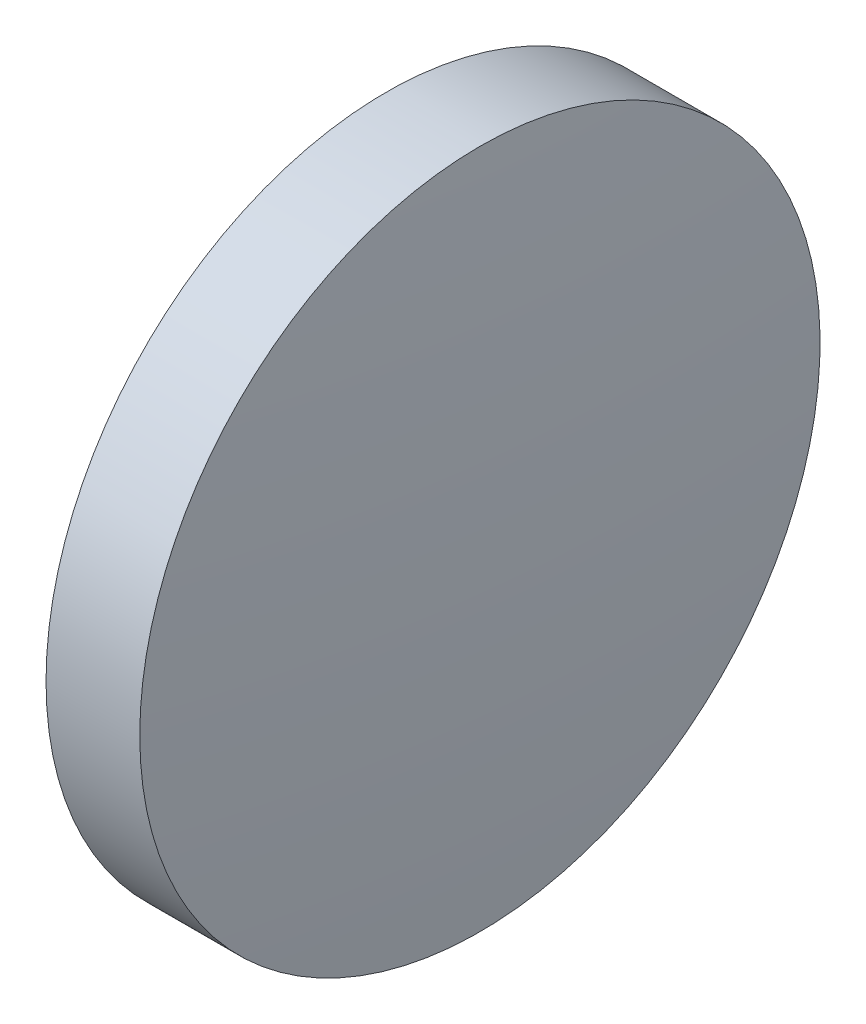
ISO-10303-21;
HEADER;
FILE_DESCRIPTION(('STEP AP214'),'2;1');
FILE_NAME('part.step','',(''),(''),'','','');
FILE_SCHEMA(('AUTOMOTIVE_DESIGN { 1 0 10303 214 1 1 1 1 }'));
ENDSEC;
DATA;
#1=APPLICATION_CONTEXT('core data for automotive mechanical design processes');
#2=APPLICATION_PROTOCOL_DEFINITION('international standard','automotive_design',2000,#1);
#3=PRODUCT_CONTEXT('',#1,'mechanical');
#4=PRODUCT('Part','Part','',(#3));
#5=PRODUCT_RELATED_PRODUCT_CATEGORY('part','',(#4));
#6=PRODUCT_DEFINITION_FORMATION('','',#4);
#7=PRODUCT_DEFINITION_CONTEXT('part definition',#1,'design');
#8=PRODUCT_DEFINITION('design','',#6,#7);
#9=PRODUCT_DEFINITION_SHAPE('','',#8);
#10=(LENGTH_UNIT() NAMED_UNIT(*) SI_UNIT(.MILLI.,.METRE.));
#11=(NAMED_UNIT(*) PLANE_ANGLE_UNIT() SI_UNIT($,.RADIAN.));
#12=(NAMED_UNIT(*) SI_UNIT($,.STERADIAN.) SOLID_ANGLE_UNIT());
#13=UNCERTAINTY_MEASURE_WITH_UNIT(LENGTH_MEASURE(1.E-05),#10,'distance_accuracy_value','');
#14=(GEOMETRIC_REPRESENTATION_CONTEXT(3) GLOBAL_UNCERTAINTY_ASSIGNED_CONTEXT((#13)) GLOBAL_UNIT_ASSIGNED_CONTEXT((#10,
#11,#12)) REPRESENTATION_CONTEXT('',''));
#15=CARTESIAN_POINT('',(0.,0.,0.));
#16=DIRECTION('',(0.,0.,1.));
#17=DIRECTION('',(1.,0.,0.));
#18=AXIS2_PLACEMENT_3D('',#15,#16,#17);
#19=CARTESIAN_POINT('',(-41.7754445237988,65.2335549264122,0.));
#20=DIRECTION('',(-1.,0.,0.));
#21=DIRECTION('',(0.,1.,0.));
#22=AXIS2_PLACEMENT_3D('',#19,#20,#21);
#23=SPHERICAL_SURFACE('',#22,161.54);
#24=CARTESIAN_POINT('',(119.264555476201,65.2335549264122,0.));
#25=DIRECTION('',(-1.,0.,0.));
#26=DIRECTION('',(0.,0.,1.));
#27=AXIS2_PLACEMENT_3D('',#24,#25,#26);
#28=CIRCLE('',#27,12.7);
#29=CARTESIAN_POINT('',(119.264555476201,65.2335549264122,12.7));
#30=VERTEX_POINT('',#29);
#31=EDGE_CURVE('E10',#30,#30,#28,.T.);
#32=ORIENTED_EDGE('',*,*,#31,.F.);
#33=EDGE_LOOP('',(#32));
#34=FACE_BOUND('',#33,.T.);
#35=ADVANCED_FACE('F35',(#34),#23,.T.);
#36=CARTESIAN_POINT('',(110.165373228488,65.2335549264122,0.));
#37=DIRECTION('',(-1.,0.,0.));
#38=DIRECTION('',(0.,0.,1.));
#39=AXIS2_PLACEMENT_3D('',#36,#37,#38);
#40=CYLINDRICAL_SURFACE('',#39,12.7);
#41=CARTESIAN_POINT('',(115.764555476201,65.2335549264122,0.));
#42=DIRECTION('',(-1.,0.,0.));
#43=DIRECTION('',(0.,0.,1.));
#44=AXIS2_PLACEMENT_3D('',#41,#42,#43);
#45=CIRCLE('',#44,12.7);
#46=CARTESIAN_POINT('',(115.764555476201,65.2335549264122,12.7));
#47=VERTEX_POINT('',#46);
#48=EDGE_CURVE('E41',#47,#47,#45,.T.);
#49=ORIENTED_EDGE('',*,*,#48,.F.);
#50=EDGE_LOOP('',(#49));
#51=FACE_BOUND('',#50,.T.);
#52=ORIENTED_EDGE('',*,*,#31,.T.);
#53=EDGE_LOOP('',(#52));
#54=FACE_BOUND('',#53,.T.);
#55=ADVANCED_FACE('F49',(#51,#54),#40,.T.);
#56=CARTESIAN_POINT('',(115.764555476201,65.2335549264122,0.));
#57=DIRECTION('',(1.,0.,0.));
#58=DIRECTION('',(0.,0.,-1.));
#59=AXIS2_PLACEMENT_3D('',#56,#57,#58);
#60=PLANE('',#59);
#61=ORIENTED_EDGE('',*,*,#48,.T.);
#62=EDGE_LOOP('',(#61));
#63=FACE_BOUND('',#62,.T.);
#64=ADVANCED_FACE('F47',(#63),#60,.F.);
#65=CLOSED_SHELL('',(#35,#55,#64));
#66=MANIFOLD_SOLID_BREP('B2',#65);
#67=ADVANCED_BREP_SHAPE_REPRESENTATION('',(#18,#66),#14);
#68=SHAPE_DEFINITION_REPRESENTATION(#9,#67);
ENDSEC;
END-ISO-10303-21;
